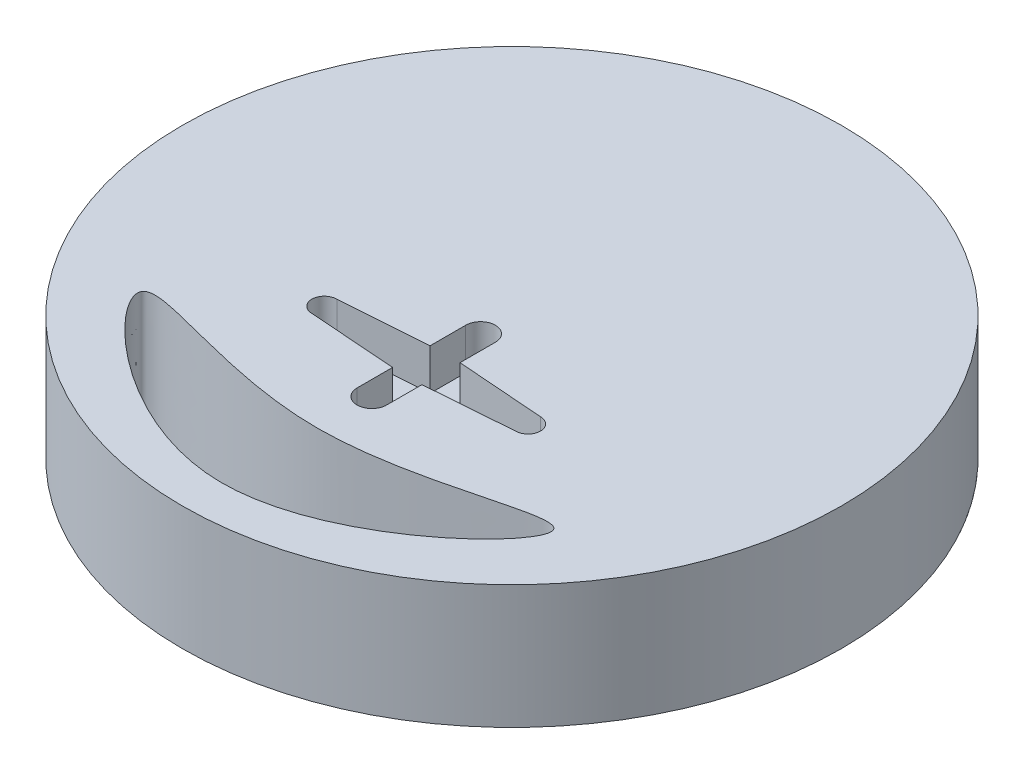
ISO-10303-21;
HEADER;
FILE_DESCRIPTION(('STEP AP214'),'2;1');
FILE_NAME('part.step','',(''),(''),'','','');
FILE_SCHEMA(('AUTOMOTIVE_DESIGN { 1 0 10303 214 1 1 1 1 }'));
ENDSEC;
DATA;
#1=APPLICATION_CONTEXT('core data for automotive mechanical design processes');
#2=APPLICATION_PROTOCOL_DEFINITION('international standard','automotive_design',2000,#1);
#3=PRODUCT_CONTEXT('',#1,'mechanical');
#4=PRODUCT('Part','Part','',(#3));
#5=PRODUCT_RELATED_PRODUCT_CATEGORY('part','',(#4));
#6=PRODUCT_DEFINITION_FORMATION('','',#4);
#7=PRODUCT_DEFINITION_CONTEXT('part definition',#1,'design');
#8=PRODUCT_DEFINITION('design','',#6,#7);
#9=PRODUCT_DEFINITION_SHAPE('','',#8);
#10=(LENGTH_UNIT() NAMED_UNIT(*) SI_UNIT(.MILLI.,.METRE.));
#11=(NAMED_UNIT(*) PLANE_ANGLE_UNIT() SI_UNIT($,.RADIAN.));
#12=(NAMED_UNIT(*) SI_UNIT($,.STERADIAN.) SOLID_ANGLE_UNIT());
#13=UNCERTAINTY_MEASURE_WITH_UNIT(LENGTH_MEASURE(1.E-05),#10,'distance_accuracy_value','');
#14=(GEOMETRIC_REPRESENTATION_CONTEXT(3) GLOBAL_UNCERTAINTY_ASSIGNED_CONTEXT((#13)) GLOBAL_UNIT_ASSIGNED_CONTEXT((#10,
#11,#12)) REPRESENTATION_CONTEXT('',''));
#15=CARTESIAN_POINT('',(0.,0.,0.));
#16=DIRECTION('',(0.,0.,1.));
#17=DIRECTION('',(1.,0.,0.));
#18=AXIS2_PLACEMENT_3D('',#15,#16,#17);
#19=CARTESIAN_POINT('',(0.,0.,0.));
#20=DIRECTION('',(0.,1.,0.));
#21=DIRECTION('',(0.,0.,-1.));
#22=AXIS2_PLACEMENT_3D('',#19,#20,#21);
#23=CONICAL_SURFACE('',#22,50.8,0.436332312998583);
#24=CARTESIAN_POINT('',(-4.94064954388163,-15.9612397023863,-43.0747325589562));
#25=CARTESIAN_POINT('',(-4.78542381678616,-16.0934445827361,-43.0304845708124));
#26=CARTESIAN_POINT('',(-4.62448546101738,-16.2197493159303,-42.9888860172424));
#27=CARTESIAN_POINT('',(-4.2920682727824,-16.4595657745197,-42.9109621062465));
#28=CARTESIAN_POINT('',(-4.12058803248645,-16.5730757854663,-42.8746374553179));
#29=CARTESIAN_POINT('',(-3.76813766102636,-16.7863109700731,-42.8072341013048));
#30=CARTESIAN_POINT('',(-3.58716177933412,-16.8860276544826,-42.776158626303));
#31=CARTESIAN_POINT('',(-3.2170403422337,-17.0707033866764,-42.719226750507));
#32=CARTESIAN_POINT('',(-3.02789483730488,-17.1556625256298,-42.6933703174704));
#33=CARTESIAN_POINT('',(-2.64267176605896,-17.3100885822414,-42.6467984673994));
#34=CARTESIAN_POINT('',(-2.44659121715198,-17.3795487379576,-42.6260852938384));
#35=CARTESIAN_POINT('',(-2.04897075342166,-17.5023028808692,-42.5897408430897));
#36=CARTESIAN_POINT('',(-1.8474307773734,-17.5555966866847,-42.5741096229194));
#37=CARTESIAN_POINT('',(-1.44040786501331,-17.6455227962455,-42.5478660226092));
#38=CARTESIAN_POINT('',(-1.23492609308615,-17.6821599436334,-42.5372521834134));
#39=CARTESIAN_POINT('',(-0.821384220979554,-17.7384754038288,-42.5209819446696));
#40=CARTESIAN_POINT('',(-0.613323257793733,-17.7581478758318,-42.5153272525056));
#41=CARTESIAN_POINT('',(-0.19858258810889,-17.7802099359792,-42.508987976848));
#42=CARTESIAN_POINT('',(0.00808599438565895,-17.7827931422066,-42.5082477134858));
#43=CARTESIAN_POINT('',(0.420915383227999,-17.7711675318268,-42.51158580484));
#44=CARTESIAN_POINT('',(0.627076180941762,-17.756958431643,-42.5156642409312));
#45=CARTESIAN_POINT('',(1.03740236410294,-17.7118735752539,-42.5286608289162));
#46=CARTESIAN_POINT('',(1.24156784753777,-17.680998641717,-42.5375787419211));
#47=CARTESIAN_POINT('',(1.64646041846587,-17.6028542289432,-42.5602980049135));
#48=CARTESIAN_POINT('',(1.84718750061752,-17.5555847242394,-42.5740993624868));
#49=CARTESIAN_POINT('',(2.24335367627987,-17.4451874992146,-42.6066112509265));
#50=CARTESIAN_POINT('',(2.43880325366779,-17.382094247127,-42.6253111154593));
#51=CARTESIAN_POINT('',(2.82349925506257,-17.2405548888415,-42.6677031299968));
#52=CARTESIAN_POINT('',(3.01274575608942,-17.162108973353,-42.6913952179887));
#53=CARTESIAN_POINT('',(3.38376692211739,-16.9905417327992,-42.7438442712354));
#54=CARTESIAN_POINT('',(3.56554052149323,-16.8974183238329,-42.7726019557686));
#55=CARTESIAN_POINT('',(3.920312329206,-16.6973550113927,-42.8352264454007));
#56=CARTESIAN_POINT('',(4.09331338622711,-16.5904196335745,-42.8690915775905));
#57=CARTESIAN_POINT('',(4.43107764280676,-16.3625673944883,-42.9423168263288));
#58=CARTESIAN_POINT('',(4.59574749035882,-16.2415279008206,-42.981725869367));
#59=CARTESIAN_POINT('',(4.91403936923113,-15.987357600568,-43.0657923165766));
#60=CARTESIAN_POINT('',(5.06766138028412,-15.8542267718025,-43.1104497303758));
#61=CARTESIAN_POINT('',(5.36293786554785,-15.5770377547202,-43.2049634936671));
#62=CARTESIAN_POINT('',(5.50459391375098,-15.4329810083352,-43.2548191574522));
#63=CARTESIAN_POINT('',(5.77524909961291,-15.135079374046,-43.3596587363182));
#64=CARTESIAN_POINT('',(5.90424367526188,-14.9812309908243,-43.4146444859848));
#65=CARTESIAN_POINT('',(6.15258378843135,-14.6602789486335,-43.5313107549775));
#66=CARTESIAN_POINT('',(6.27152279281264,-14.4929158717343,-43.5931428187805));
#67=CARTESIAN_POINT('',(6.49478625624578,-14.1504820685431,-43.7218769426413));
#68=CARTESIAN_POINT('',(6.59910536486851,-13.9754085511144,-43.7887808451039));
#69=CARTESIAN_POINT('',(6.79270617148461,-13.6189975271888,-43.9273464013323));
#70=CARTESIAN_POINT('',(6.88199051102022,-13.4376611278136,-43.9990072162385));
#71=CARTESIAN_POINT('',(7.04536014889055,-13.0699477484179,-44.1467889758281));
#72=CARTESIAN_POINT('',(7.11943969268534,-12.8835688900779,-44.2229115952043));
#73=CARTESIAN_POINT('',(7.25644411232013,-12.4952572349125,-44.3841282881857));
#74=CARTESIAN_POINT('',(7.31837554105366,-12.293082997354,-44.4694855312151));
#75=CARTESIAN_POINT('',(7.42495732904638,-11.8858982017481,-44.6443064671316));
#76=CARTESIAN_POINT('',(7.46960120446606,-11.680886609328,-44.7337716867045));
#77=CARTESIAN_POINT('',(7.54169644389535,-11.2694257159537,-44.9162387099558));
#78=CARTESIAN_POINT('',(7.56914853765107,-11.0629764764001,-45.0092403633441));
#79=CARTESIAN_POINT('',(7.60707096357232,-10.6498485961495,-45.1982106567499));
#80=CARTESIAN_POINT('',(7.6175351822263,-10.4431698996405,-45.2941803522357));
#81=CARTESIAN_POINT('',(7.62412501240004,-9.78865368497306,-45.6025599419786));
#82=CARTESIAN_POINT('',(7.58903763881434,-9.34228561748734,-45.819518506158));
#83=CARTESIAN_POINT('',(7.44232313096322,-8.46459011675443,-46.2581572169124));
#84=CARTESIAN_POINT('',(7.33066121101305,-8.0332696128148,-46.4798394649614));
#85=CARTESIAN_POINT('',(7.10306139103742,-7.39102016310779,-46.8178443708605));
#86=CARTESIAN_POINT('',(7.01334072017891,-7.1710133207354,-46.9351468605341));
#87=CARTESIAN_POINT('',(6.8133332916047,-6.73956503593674,-47.1678828035859));
#88=CARTESIAN_POINT('',(6.70305398775994,-6.52812052281115,-47.2833169179405));
#89=CARTESIAN_POINT('',(6.46227683259978,-6.11518328479115,-47.5111605695698));
#90=CARTESIAN_POINT('',(6.33176888980107,-5.91369559359481,-47.6235685641702));
#91=CARTESIAN_POINT('',(6.05100070555801,-5.52235161797404,-47.8440013748957));
#92=CARTESIAN_POINT('',(5.90073846170917,-5.33249651555679,-47.9520257452178));
#93=CARTESIAN_POINT('',(5.58387657652374,-4.96945794585552,-48.1603690016013));
#94=CARTESIAN_POINT('',(5.41761786349451,-4.79603673170848,-48.2607912643954));
#95=CARTESIAN_POINT('',(5.06732238752572,-4.46396200433227,-48.4545225808732));
#96=CARTESIAN_POINT('',(4.88329510983054,-4.3053006997966,-48.5478353826617));
#97=CARTESIAN_POINT('',(4.49837958276756,-4.00462935944555,-48.7258143238974));
#98=CARTESIAN_POINT('',(4.2975003884272,-3.86261047826306,-48.8104850534482));
#99=CARTESIAN_POINT('',(3.88002648036769,-3.59715413033617,-48.9696147317948));
#100=CARTESIAN_POINT('',(3.66343484140377,-3.47371304257759,-49.0440756703379));
#101=CARTESIAN_POINT('',(3.24412279568124,-3.2615814754616,-49.1726051324605));
#102=CARTESIAN_POINT('',(3.04304662883241,-3.17047652960923,-49.2280589846383));
#103=CARTESIAN_POINT('',(2.63155814758678,-3.00539180242085,-49.3288583215697));
#104=CARTESIAN_POINT('',(2.42114771534955,-2.93140858719818,-49.3742058331553));
#105=CARTESIAN_POINT('',(1.99293915622632,-2.80183587414655,-49.453811372613));
#106=CARTESIAN_POINT('',(1.77514914933112,-2.7462268396379,-49.4880811782094));
#107=CARTESIAN_POINT('',(1.3340334695487,-2.65430321500096,-49.5448152223458));
#108=CARTESIAN_POINT('',(1.11070869079266,-2.61798552938708,-49.5672813548942));
#109=CARTESIAN_POINT('',(0.694058988458415,-2.56921821086434,-49.5974695764474));
#110=CARTESIAN_POINT('',(0.501170051903149,-2.55403735024322,-49.6068781431012));
#111=CARTESIAN_POINT('',(0.114573884359551,-2.5384067261275,-49.6165656643833));
#112=CARTESIAN_POINT('',(-0.0791332683923379,-2.53795558472487,-49.6168454729713));
#113=CARTESIAN_POINT('',(-0.465760498542645,-2.55178864647313,-49.6082716858447));
#114=CARTESIAN_POINT('',(-0.658680773519966,-2.56606888860061,-49.5994205452899));
#115=CARTESIAN_POINT('',(-1.04226447712294,-2.60915031885127,-49.5727493503648));
#116=CARTESIAN_POINT('',(-1.23292790888786,-2.63795148677346,-49.5549293084716));
#117=CARTESIAN_POINT('',(-1.60010738738229,-2.70768298899212,-49.511860746843));
#118=CARTESIAN_POINT('',(-1.77682304940351,-2.74785523477206,-49.4870770686027));
#119=CARTESIAN_POINT('',(-2.12589530156655,-2.84032921260624,-49.4301499905795));
#120=CARTESIAN_POINT('',(-2.29825048534985,-2.89263480400988,-49.3980042491281));
#121=CARTESIAN_POINT('',(-2.63750600024856,-3.00876928935041,-49.3268210368129));
#122=CARTESIAN_POINT('',(-2.80440779837309,-3.07259505361021,-49.2877854377753));
#123=CARTESIAN_POINT('',(-3.13201228839053,-3.21114773290973,-49.2033144575053));
#124=CARTESIAN_POINT('',(-3.29271259165456,-3.28587879638313,-49.1578766410631));
#125=CARTESIAN_POINT('',(-3.61688238695095,-3.45048342093602,-49.0581581383005));
#126=CARTESIAN_POINT('',(-3.77990667116278,-3.54100826458721,-49.0035040132382));
#127=CARTESIAN_POINT('',(-4.0974059482006,-3.73270697984957,-48.8882761822077));
#128=CARTESIAN_POINT('',(-4.25187781276202,-3.83388470926902,-48.8277003323335));
#129=CARTESIAN_POINT('',(-4.70154446224845,-4.15212206661073,-48.6381090617147));
#130=CARTESIAN_POINT('',(-4.98314520241094,-4.38396547086069,-48.5011813924464));
#131=CARTESIAN_POINT('',(-5.54074097670515,-4.91298141790584,-48.1925785474159));
#132=CARTESIAN_POINT('',(-5.81113439049339,-5.21473537183066,-48.018701782568));
#133=CARTESIAN_POINT('',(-6.29803076981837,-5.85184799876738,-47.6576186118188));
#134=CARTESIAN_POINT('',(-6.5145034829517,-6.18722538901312,-47.4704047985229));
#135=CARTESIAN_POINT('',(-6.91671515828582,-6.9311966694663,-47.0629988186111));
#136=CARTESIAN_POINT('',(-7.09445981032618,-7.3435815945777,-46.8417470355488));
#137=CARTESIAN_POINT('',(-7.30484612656631,-7.97970728130226,-46.5089117279273));
#138=CARTESIAN_POINT('',(-7.36562221829991,-8.19480506792741,-46.3977416061592));
#139=CARTESIAN_POINT('',(-7.46812598877368,-8.62983885324082,-46.1758703323664));
#140=CARTESIAN_POINT('',(-7.50985124858616,-8.84977546261133,-46.0651692416626));
#141=CARTESIAN_POINT('',(-7.57597296624918,-9.30788060946147,-45.8378423220908));
#142=CARTESIAN_POINT('',(-7.59903356791025,-9.54628945055965,-45.7213116506189));
#143=CARTESIAN_POINT('',(-7.62258298154331,-10.0253859968846,-45.4908859498037));
#144=CARTESIAN_POINT('',(-7.62308025462988,-10.266072814018,-45.3769899484889));
#145=CARTESIAN_POINT('',(-7.60109622774876,-10.7482257346369,-45.1526984827524));
#146=CARTESIAN_POINT('',(-7.57860055975343,-10.9896922312875,-45.0423052516438));
#147=CARTESIAN_POINT('',(-7.51026980338654,-11.4712400857959,-44.826085617354));
#148=CARTESIAN_POINT('',(-7.46444629469419,-11.7113220711695,-44.7202569766058));
#149=CARTESIAN_POINT('',(-7.35112687752598,-12.1802961581998,-44.517389782394));
#150=CARTESIAN_POINT('',(-7.28439325415942,-12.4092966026791,-44.4201766099671));
#151=CARTESIAN_POINT('',(-7.12886544872208,-12.8620237851206,-44.2315806532252));
#152=CARTESIAN_POINT('',(-7.04008227188885,-13.0857530931724,-44.1401949888309));
#153=CARTESIAN_POINT('',(-6.84072116841345,-13.5255818995758,-43.9639786628871));
#154=CARTESIAN_POINT('',(-6.73017274402572,-13.7416912641262,-43.8791393422448));
#155=CARTESIAN_POINT('',(-6.48768201233099,-14.1642111632018,-43.716475028455));
#156=CARTESIAN_POINT('',(-6.35574762345556,-14.3706252511837,-43.6386474556473));
#157=CARTESIAN_POINT('',(-6.03307255244352,-14.8251295854521,-43.4705865876554));
#158=CARTESIAN_POINT('',(-5.8360381133416,-15.0696202482003,-43.3825943449552));
#159=CARTESIAN_POINT('',(-5.41084620407821,-15.5346003429879,-43.2191660441501));
#160=CARTESIAN_POINT('',(-5.18269274815035,-15.7550928641102,-43.1437283693361));
#161=CARTESIAN_POINT('',(-4.94064954388163,-15.9612397023863,-43.0747325589562));
#162=B_SPLINE_CURVE_WITH_KNOTS('',3,(#24,#25,#26,#27,#28,#29,#30,#31,#32,#33,#34,#35,#36,#37,
#38,#39,#40,#41,#42,#43,#44,#45,#46,#47,#48,#49,#50,#51,#52,#53,#54,#55,#56,#57,#58,#59,#60,#61,
#62,#63,#64,#65,#66,#67,#68,#69,#70,#71,#72,#73,#74,#75,#76,#77,#78,#79,#80,#81,#82,#83,#84,#85,
#86,#87,#88,#89,#90,#91,#92,#93,#94,#95,#96,#97,#98,#99,#100,#101,#102,#103,#104,#105,#106,#107,
#108,#109,#110,#111,#112,#113,#114,#115,#116,#117,#118,#119,#120,#121,#122,#123,#124,#125,#126,
#127,#128,#129,#130,#131,#132,#133,#134,#135,#136,#137,#138,#139,#140,#141,#142,#143,#144,#145,
#146,#147,#148,#149,#150,#151,#152,#153,#154,#155,#156,#157,#158,#159,#160,#161),.UNSPECIFIED.,
.T.,.F.,(4,2,2,2,2,2,2,2,2,2,2,2,2,2,2,2,2,2,2,2,2,2,2,2,2,2,2,2,2,2,2,2,2,2,2,2,2,2,2,2,2,2,2,
2,2,2,2,2,2,2,2,2,2,2,2,2,2,2,2,2,2,2,2,2,2,2,2,2,4),(0.,0.625654194815607,1.25139212571434,
1.87751347630843,2.50363095870924,3.13002107368822,3.75641821624921,4.38263309010459,
5.00906347884563,5.6283841949057,6.24771536976786,6.8670159756496,7.48631754354006,
8.10428165341961,8.72223808749009,9.34028233777179,9.95812458981055,10.5818083945611,
11.2054933434307,11.8290961251556,12.4529227764752,13.0954989001266,13.7383095760587,
14.3810071949018,15.0239476079969,15.7072890648919,16.3908865669755,17.0744550501689,
17.7582694780822,19.244123969548,20.7306538908613,21.524782455523,22.3186236538013,
23.1128621587542,23.9071812342506,24.6872694405925,25.4669434973728,26.2462012634191,
27.0253069463871,27.7071425208825,28.3888412295956,29.0698127597146,29.7506749882587,
30.3310672469689,30.9114052120814,31.4915871746526,32.0717683300968,32.6198931615292,
33.1681925790165,33.7163432639833,34.2647030145936,34.8470343887665,35.4295773769989,
36.5941264876107,37.9117401104199,39.2300913283667,40.7249382079342,41.4732389943382,
42.2216347677988,43.0197652074483,43.8175963504356,44.615926354026,45.4138604613736,
46.1855534183894,46.9568619841083,47.7271321699698,48.4971178020217,49.4728250353663,
50.4484065250519),.UNSPECIFIED.);
#163=CARTESIAN_POINT('',(-4.94064954388163,-15.9612397023863,-43.0747325589562));
#164=VERTEX_POINT('',#163);
#165=EDGE_CURVE('E116',#164,#164,#162,.T.);
#166=ORIENTED_EDGE('',*,*,#165,.T.);
#167=EDGE_LOOP('',(#166));
#168=FACE_BOUND('',#167,.T.);
#169=CARTESIAN_POINT('',(0.,0.,0.));
#170=DIRECTION('',(0.,-1.,0.));
#171=DIRECTION('',(0.,0.,-1.));
#172=AXIS2_PLACEMENT_3D('',#169,#170,#171);
#173=CIRCLE('',#172,50.8);
#174=CARTESIAN_POINT('',(-44.4378772627048,0.,-24.6153420529715));
#175=VERTEX_POINT('',#174);
#176=CARTESIAN_POINT('',(44.4378772627048,0.,-24.6153420529715));
#177=VERTEX_POINT('',#176);
#178=EDGE_CURVE('E102',#175,#177,#173,.T.);
#179=ORIENTED_EDGE('',*,*,#178,.T.);
#180=CARTESIAN_POINT('',(25.1966605302614,-19.05,-33.4985029408242));
#181=CARTESIAN_POINT('',(25.6655434032636,-18.7140361881099,-33.3418404424769));
#182=CARTESIAN_POINT('',(26.1293846111233,-18.3723337848862,-33.1825019950437));
#183=CARTESIAN_POINT('',(27.0472696427902,-17.6783601409286,-32.8588967703086));
#184=CARTESIAN_POINT('',(27.5013144000333,-17.3260899148433,-32.694630466145));
#185=CARTESIAN_POINT('',(28.3997404352072,-16.6120164043351,-32.3616525197094));
#186=CARTESIAN_POINT('',(28.8441267791353,-16.2502183490027,-32.1929433158023));
#187=CARTESIAN_POINT('',(29.7238304779451,-15.5176726935929,-31.8513516667366));
#188=CARTESIAN_POINT('',(30.1591475933975,-15.1469248577959,-31.67846911166));
#189=CARTESIAN_POINT('',(31.4480003348301,-14.0258131649598,-31.1556861436434));
#190=CARTESIAN_POINT('',(32.2886362519184,-13.2632244743252,-30.8000851971781));
#191=CARTESIAN_POINT('',(33.9380197938201,-11.7101496466371,-30.0758745113394));
#192=CARTESIAN_POINT('',(34.7467627159158,-10.9196594277441,-29.707262868573));
#193=CARTESIAN_POINT('',(36.3335284974515,-9.31601646271963,-28.9594718730357));
#194=CARTESIAN_POINT('',(37.1115973770021,-8.5029010517763,-28.580309929949));
#195=CARTESIAN_POINT('',(38.6406303518196,-6.85606474597936,-27.8123775488282));
#196=CARTESIAN_POINT('',(39.3915947104501,-6.02234405147161,-27.4236072042169));
#197=CARTESIAN_POINT('',(40.8720407150352,-4.33295263534972,-26.6358310492579));
#198=CARTESIAN_POINT('',(41.601403850738,-3.47719669575725,-26.2367855011143));
#199=CARTESIAN_POINT('',(42.6779156248753,-2.18173549922506,-25.6327020243287));
#200=CARTESIAN_POINT('',(43.0338096690425,-1.74797055931725,-25.4304341110106));
#201=CARTESIAN_POINT('',(43.7399901780582,-0.876720280559472,-25.0241634338561));
#202=CARTESIAN_POINT('',(44.0902767571993,-0.439235017816914,-24.8201607055093));
#203=CARTESIAN_POINT('',(44.4378772627048,0.,-24.6153420529715));
#204=B_SPLINE_CURVE_WITH_KNOTS('',3,(#180,#181,#182,#183,#184,#185,#186,#187,#188,#189,#190,
#191,#192,#193,#194,#195,#196,#197,#198,#199,#200,#201,#202,#203),.UNSPECIFIED.,.F.,.F.,(4,2,2,
2,2,2,2,2,2,2,2,4),(0.,1.79305564995433,3.5859396907591,5.3778594597075,7.16982647588538,
10.7369779242623,14.3046534079525,17.8667550969064,21.4288221650419,25.0077497428421,
26.7969964519758,28.5862066457578),.UNSPECIFIED.);
#205=CARTESIAN_POINT('',(25.1966605302614,-19.05,-33.4985029408242));
#206=VERTEX_POINT('',#205);
#207=EDGE_CURVE('E12',#206,#177,#204,.T.);
#208=ORIENTED_EDGE('',*,*,#207,.F.);
#209=CARTESIAN_POINT('',(0.,-19.05,0.));
#210=DIRECTION('',(0.,-1.,0.));
#211=DIRECTION('',(0.,0.,-1.));
#212=AXIS2_PLACEMENT_3D('',#209,#210,#211);
#213=CIRCLE('',#212,41.9168391121473);
#214=CARTESIAN_POINT('',(-25.1966605302614,-19.05,-33.4985029408242));
#215=VERTEX_POINT('',#214);
#216=EDGE_CURVE('E131',#215,#206,#213,.T.);
#217=ORIENTED_EDGE('',*,*,#216,.F.);
#218=CARTESIAN_POINT('',(-25.1966605302614,-19.05,-33.4985029408242));
#219=CARTESIAN_POINT('',(-25.6655434032636,-18.7140361881099,-33.3418404424769));
#220=CARTESIAN_POINT('',(-26.1293846111233,-18.3723337848862,-33.1825019950437));
#221=CARTESIAN_POINT('',(-27.0472696427902,-17.6783601409286,-32.8588967703086));
#222=CARTESIAN_POINT('',(-27.5013144000333,-17.3260899148433,-32.694630466145));
#223=CARTESIAN_POINT('',(-28.3997404352072,-16.6120164043351,-32.3616525197094));
#224=CARTESIAN_POINT('',(-28.8441267791353,-16.2502183490027,-32.1929433158023));
#225=CARTESIAN_POINT('',(-29.7238304779451,-15.5176726935929,-31.8513516667366));
#226=CARTESIAN_POINT('',(-30.1591475933975,-15.1469248577959,-31.67846911166));
#227=CARTESIAN_POINT('',(-31.4480003348301,-14.0258131649598,-31.1556861436434));
#228=CARTESIAN_POINT('',(-32.2886362519184,-13.2632244743252,-30.8000851971781));
#229=CARTESIAN_POINT('',(-33.9380197938201,-11.7101496466371,-30.0758745113394));
#230=CARTESIAN_POINT('',(-34.7467627159158,-10.9196594277441,-29.707262868573));
#231=CARTESIAN_POINT('',(-36.3335284974515,-9.31601646271963,-28.9594718730357));
#232=CARTESIAN_POINT('',(-37.1115973770021,-8.5029010517763,-28.580309929949));
#233=CARTESIAN_POINT('',(-38.6406303518196,-6.85606474597936,-27.8123775488282));
#234=CARTESIAN_POINT('',(-39.3915947104501,-6.02234405147161,-27.4236072042169));
#235=CARTESIAN_POINT('',(-40.8720407150352,-4.33295263534972,-26.6358310492579));
#236=CARTESIAN_POINT('',(-41.601403850738,-3.47719669575725,-26.2367855011143));
#237=CARTESIAN_POINT('',(-42.6779156248753,-2.18173549922506,-25.6327020243287));
#238=CARTESIAN_POINT('',(-43.0338096690425,-1.74797055931725,-25.4304341110106));
#239=CARTESIAN_POINT('',(-43.7399901780582,-0.876720280559472,-25.0241634338561));
#240=CARTESIAN_POINT('',(-44.0902767571993,-0.439235017816914,-24.8201607055093));
#241=CARTESIAN_POINT('',(-44.4378772627048,0.,-24.6153420529715));
#242=B_SPLINE_CURVE_WITH_KNOTS('',3,(#218,#219,#220,#221,#222,#223,#224,#225,#226,#227,#228,
#229,#230,#231,#232,#233,#234,#235,#236,#237,#238,#239,#240,#241),.UNSPECIFIED.,.F.,.F.,(4,2,2,
2,2,2,2,2,2,2,2,4),(0.,1.79305564995433,3.5859396907591,5.3778594597075,7.16982647588538,
10.7369779242623,14.3046534079525,17.8667550969064,21.4288221650419,25.0077497428421,
26.7969964519758,28.5862066457578),.UNSPECIFIED.);
#243=EDGE_CURVE('E115',#215,#175,#242,.T.);
#244=ORIENTED_EDGE('',*,*,#243,.T.);
#245=EDGE_LOOP('',(#179,#208,#217,#244));
#246=FACE_BOUND('',#245,.T.);
#247=ADVANCED_FACE('F43',(#168,#246),#23,.T.);
#248=CARTESIAN_POINT('',(25.3878772627048,0.,-24.6153420529715));
#249=DIRECTION('',(0.,-0.4226182617407,0.90630778703665));
#250=DIRECTION('',(0.,-0.90630778703665,-0.4226182617407));
#251=AXIS2_PLACEMENT_3D('',#248,#249,#250);
#252=PLANE('',#251);
#253=DIRECTION('',(-1.,0.,0.));
#254=VECTOR('',#253,1.);
#255=CARTESIAN_POINT('',(25.3878772627048,0.,-24.6153420529715));
#256=LINE('',#255,#254);
#257=CARTESIAN_POINT('',(25.3878772627048,0.,-24.6153420529715));
#258=VERTEX_POINT('',#257);
#259=EDGE_CURVE('E98',#177,#258,#256,.T.);
#260=ORIENTED_EDGE('',*,*,#259,.T.);
#261=DIRECTION('',(0.308248016118225,0.862176061817301,0.402039300303326));
#262=VECTOR('',#261,1.);
#263=CARTESIAN_POINT('',(25.3878772627048,0.,-24.6153420529715));
#264=LINE('',#263,#262);
#265=CARTESIAN_POINT('',(18.5770587221449,-19.05,-33.4985029408242));
#266=VERTEX_POINT('',#265);
#267=EDGE_CURVE('E52',#266,#258,#264,.T.);
#268=ORIENTED_EDGE('',*,*,#267,.F.);
#269=DIRECTION('',(1.,0.,0.));
#270=VECTOR('',#269,1.);
#271=CARTESIAN_POINT('',(25.3878772627048,-19.05,-33.4985029408242));
#272=LINE('',#271,#270);
#273=EDGE_CURVE('E111',#206,#266,#272,.F.);
#274=ORIENTED_EDGE('',*,*,#273,.F.);
#275=ORIENTED_EDGE('',*,*,#207,.T.);
#276=EDGE_LOOP('',(#260,#268,#274,#275));
#277=FACE_BOUND('',#276,.T.);
#278=ADVANCED_FACE('F110',(#277),#252,.T.);
#279=CARTESIAN_POINT('',(14.224,0.,16.9199535512611));
#280=DIRECTION('',(0.875243936985389,-0.4226182617407,0.235248497579869));
#281=DIRECTION('',(0.434821412810883,0.90051670665299,0.));
#282=AXIS2_PLACEMENT_3D('',#279,#280,#281);
#283=PLANE('',#282);
#284=DIRECTION('',(-0.259567997698729,0.,0.965724833775477));
#285=VECTOR('',#284,1.);
#286=CARTESIAN_POINT('',(14.224,0.,16.9199535512611));
#287=LINE('',#286,#285);
#288=CARTESIAN_POINT('',(14.224,0.,16.9199535512611));
#289=VERTEX_POINT('',#288);
#290=EDGE_CURVE('E104',#258,#289,#287,.T.);
#291=ORIENTED_EDGE('',*,*,#290,.T.);
#292=DIRECTION('',(0.308248016118225,0.862176061817301,0.402039300303326));
#293=VECTOR('',#292,1.);
#294=CARTESIAN_POINT('',(11.6657666148953,-7.15543156758921,13.5833210138902));
#295=LINE('',#294,#293);
#296=CARTESIAN_POINT('',(7.4131814594401,-19.05,8.03679266340831));
#297=VERTEX_POINT('',#296);
#298=EDGE_CURVE('E174',#297,#289,#295,.T.);
#299=ORIENTED_EDGE('',*,*,#298,.F.);
#300=DIRECTION('',(0.259567997698729,0.,-0.965724833775477));
#301=VECTOR('',#300,1.);
#302=CARTESIAN_POINT('',(5.64531092817759,-19.05,14.6141692663655));
#303=LINE('',#302,#301);
#304=EDGE_CURVE('E184',#266,#297,#303,.F.);
#305=ORIENTED_EDGE('',*,*,#304,.F.);
#306=ORIENTED_EDGE('',*,*,#267,.T.);
#307=EDGE_LOOP('',(#291,#299,#305,#306));
#308=FACE_BOUND('',#307,.T.);
#309=ADVANCED_FACE('F45',(#308),#283,.T.);
#310=CARTESIAN_POINT('',(-12.7,0.,16.9199535512611));
#311=DIRECTION('',(0.,-0.4226182617407,0.90630778703665));
#312=DIRECTION('',(0.,-0.90630778703665,-0.4226182617407));
#313=AXIS2_PLACEMENT_3D('',#310,#311,#312);
#314=PLANE('',#313);
#315=CARTESIAN_POINT('',(0.,-10.16,12.1822677444063));
#316=DIRECTION('',(0.,-0.4226182617407,0.90630778703665));
#317=DIRECTION('',(0.,0.90630778703665,0.4226182617407));
#318=AXIS2_PLACEMENT_3D('',#315,#316,#317);
#319=ELLIPSE('',#318,8.40773974249419,7.62);
#320=CARTESIAN_POINT('',(0.,-2.54,15.7355320995474));
#321=VERTEX_POINT('',#320);
#322=EDGE_CURVE('E47',#321,#321,#319,.F.);
#323=ORIENTED_EDGE('',*,*,#322,.T.);
#324=EDGE_LOOP('',(#323));
#325=FACE_BOUND('',#324,.T.);
#326=DIRECTION('',(-1.,0.,0.));
#327=VECTOR('',#326,1.);
#328=CARTESIAN_POINT('',(-12.7,0.,16.9199535512611));
#329=LINE('',#328,#327);
#330=CARTESIAN_POINT('',(-12.7,0.,16.9199535512611));
#331=VERTEX_POINT('',#330);
#332=EDGE_CURVE('E126',#289,#331,#329,.T.);
#333=ORIENTED_EDGE('',*,*,#332,.T.);
#334=DIRECTION('',(-0.298534422054389,0.864979125821701,0.403346390514876));
#335=VECTOR('',#334,1.);
#336=CARTESIAN_POINT('',(-12.7,0.,16.9199535512611));
#337=LINE('',#336,#335);
#338=CARTESIAN_POINT('',(-6.12518152130715,-19.05,8.03679266340831));
#339=VERTEX_POINT('',#338);
#340=EDGE_CURVE('E172',#339,#331,#337,.T.);
#341=ORIENTED_EDGE('',*,*,#340,.F.);
#342=DIRECTION('',(1.,0.,0.));
#343=VECTOR('',#342,1.);
#344=CARTESIAN_POINT('',(-12.7,-19.05,8.03679266340831));
#345=LINE('',#344,#343);
#346=EDGE_CURVE('E186',#297,#339,#345,.F.);
#347=ORIENTED_EDGE('',*,*,#346,.F.);
#348=ORIENTED_EDGE('',*,*,#298,.T.);
#349=EDGE_LOOP('',(#333,#341,#347,#348));
#350=FACE_BOUND('',#349,.T.);
#351=ADVANCED_FACE('F157',(#325,#350),#314,.T.);
#352=CARTESIAN_POINT('',(-12.7,0.,16.9199535512611));
#353=DIRECTION('',(-0.866769069756242,-0.4226182617407,0.264773836617534));
#354=DIRECTION('',(0.438259507378909,-0.898848487895483,0.));
#355=AXIS2_PLACEMENT_3D('',#352,#353,#354);
#356=PLANE('',#355);
#357=DIRECTION('',(-0.29214560484277,0.,-0.956373852408697));
#358=VECTOR('',#357,1.);
#359=CARTESIAN_POINT('',(-12.7,0.,16.9199535512611));
#360=LINE('',#359,#358);
#361=CARTESIAN_POINT('',(-25.3878772627048,0.,-24.6153420529715));
#362=VERTEX_POINT('',#361);
#363=EDGE_CURVE('E128',#331,#362,#360,.T.);
#364=ORIENTED_EDGE('',*,*,#363,.T.);
#365=DIRECTION('',(-0.298534422054389,0.864979125821701,0.403346390514876));
#366=VECTOR('',#365,1.);
#367=CARTESIAN_POINT('',(-29.2584785778447,11.2147514478717,-19.385817568524));
#368=LINE('',#367,#366);
#369=CARTESIAN_POINT('',(-18.813058784012,-19.05,-33.4985029408242));
#370=VERTEX_POINT('',#369);
#371=EDGE_CURVE('E177',#370,#362,#368,.T.);
#372=ORIENTED_EDGE('',*,*,#371,.F.);
#373=DIRECTION('',(0.29214560484277,0.,0.956373852408697));
#374=VECTOR('',#373,1.);
#375=CARTESIAN_POINT('',(-4.20437720011801,-19.05,14.3247771407637));
#376=LINE('',#375,#374);
#377=EDGE_CURVE('E65',#339,#370,#376,.F.);
#378=ORIENTED_EDGE('',*,*,#377,.F.);
#379=ORIENTED_EDGE('',*,*,#340,.T.);
#380=EDGE_LOOP('',(#364,#372,#378,#379));
#381=FACE_BOUND('',#380,.T.);
#382=ADVANCED_FACE('F154',(#381),#356,.T.);
#383=CARTESIAN_POINT('',(-44.4378772627048,0.,-24.6153420529715));
#384=DIRECTION('',(0.,-0.4226182617407,0.90630778703665));
#385=DIRECTION('',(0.,-0.90630778703665,-0.4226182617407));
#386=AXIS2_PLACEMENT_3D('',#383,#384,#385);
#387=PLANE('',#386);
#388=DIRECTION('',(-1.,0.,0.));
#389=VECTOR('',#388,1.);
#390=CARTESIAN_POINT('',(-44.4378772627048,0.,-24.6153420529715));
#391=LINE('',#390,#389);
#392=EDGE_CURVE('E130',#362,#175,#391,.T.);
#393=ORIENTED_EDGE('',*,*,#392,.T.);
#394=ORIENTED_EDGE('',*,*,#243,.F.);
#395=DIRECTION('',(1.,0.,0.));
#396=VECTOR('',#395,1.);
#397=CARTESIAN_POINT('',(-44.4378772627048,-19.05,-33.4985029408242));
#398=LINE('',#397,#396);
#399=EDGE_CURVE('E60',#370,#215,#398,.F.);
#400=ORIENTED_EDGE('',*,*,#399,.F.);
#401=ORIENTED_EDGE('',*,*,#371,.T.);
#402=EDGE_LOOP('',(#393,#394,#400,#401));
#403=FACE_BOUND('',#402,.T.);
#404=ADVANCED_FACE('F147',(#403),#387,.T.);
#405=CARTESIAN_POINT('',(0.,-19.05,0.));
#406=DIRECTION('',(0.,-1.,0.));
#407=DIRECTION('',(0.,0.,-1.));
#408=AXIS2_PLACEMENT_3D('',#405,#406,#407);
#409=PLANE('',#408);
#410=ORIENTED_EDGE('',*,*,#216,.T.);
#411=ORIENTED_EDGE('',*,*,#273,.T.);
#412=ORIENTED_EDGE('',*,*,#304,.T.);
#413=ORIENTED_EDGE('',*,*,#346,.T.);
#414=ORIENTED_EDGE('',*,*,#377,.T.);
#415=ORIENTED_EDGE('',*,*,#399,.T.);
#416=EDGE_LOOP('',(#410,#411,#412,#413,#414,#415));
#417=FACE_BOUND('',#416,.T.);
#418=ADVANCED_FACE('F153',(#417),#409,.T.);
#419=CARTESIAN_POINT('',(0.,0.,0.));
#420=DIRECTION('',(0.,-1.,0.));
#421=DIRECTION('',(0.,0.,-1.));
#422=AXIS2_PLACEMENT_3D('',#419,#420,#421);
#423=PLANE('',#422);
#424=ORIENTED_EDGE('',*,*,#178,.F.);
#425=ORIENTED_EDGE('',*,*,#392,.F.);
#426=ORIENTED_EDGE('',*,*,#363,.F.);
#427=ORIENTED_EDGE('',*,*,#332,.F.);
#428=ORIENTED_EDGE('',*,*,#290,.F.);
#429=ORIENTED_EDGE('',*,*,#259,.F.);
#430=EDGE_LOOP('',(#424,#425,#426,#427,#428,#429));
#431=FACE_BOUND('',#430,.T.);
#432=ADVANCED_FACE('F99',(#431),#423,.F.);
#433=CARTESIAN_POINT('',(0.,-10.16,-50.8));
#434=DIRECTION('',(0.,0.,1.));
#435=DIRECTION('',(1.,0.,0.));
#436=AXIS2_PLACEMENT_3D('',#433,#434,#435);
#437=CYLINDRICAL_SURFACE('',#436,7.62);
#438=ORIENTED_EDGE('',*,*,#322,.F.);
#439=EDGE_LOOP('',(#438));
#440=FACE_BOUND('',#439,.T.);
#441=ORIENTED_EDGE('',*,*,#165,.F.);
#442=EDGE_LOOP('',(#441));
#443=FACE_BOUND('',#442,.T.);
#444=ADVANCED_FACE('F194',(#440,#443),#437,.F.);
#445=CLOSED_SHELL('',(#247,#278,#309,#351,#382,#404,#418,#432,#444));
#446=MANIFOLD_SOLID_BREP('B2',#445);
#447=CARTESIAN_POINT('',(0.,19.05,0.));
#448=DIRECTION('',(0.,-1.,0.));
#449=DIRECTION('',(0.,0.,-1.));
#450=AXIS2_PLACEMENT_3D('',#447,#448,#449);
#451=CYLINDRICAL_SURFACE('',#450,50.8);
#452=CARTESIAN_POINT('',(0.,19.05,0.));
#453=DIRECTION('',(0.,1.,0.));
#454=DIRECTION('',(0.,0.,1.));
#455=AXIS2_PLACEMENT_3D('',#452,#453,#454);
#456=CIRCLE('',#455,50.8);
#457=CARTESIAN_POINT('',(0.,19.05,50.8));
#458=VERTEX_POINT('',#457);
#459=EDGE_CURVE('E41',#458,#458,#456,.T.);
#460=ORIENTED_EDGE('',*,*,#459,.F.);
#461=EDGE_LOOP('',(#460));
#462=FACE_BOUND('',#461,.T.);
#463=CARTESIAN_POINT('',(0.,0.,0.));
#464=DIRECTION('',(0.,1.,0.));
#465=DIRECTION('',(0.,0.,1.));
#466=AXIS2_PLACEMENT_3D('',#463,#464,#465);
#467=CIRCLE('',#466,50.8);
#468=CARTESIAN_POINT('',(0.,0.,50.8));
#469=VERTEX_POINT('',#468);
#470=EDGE_CURVE('E256',#469,#469,#467,.T.);
#471=ORIENTED_EDGE('',*,*,#470,.T.);
#472=EDGE_LOOP('',(#471));
#473=FACE_BOUND('',#472,.T.);
#474=ADVANCED_FACE('F253',(#462,#473),#451,.T.);
#475=CARTESIAN_POINT('',(0.,19.05,0.));
#476=DIRECTION('',(0.,1.,0.));
#477=DIRECTION('',(0.,0.,1.));
#478=AXIS2_PLACEMENT_3D('',#475,#476,#477);
#479=PLANE('',#478);
#480=CARTESIAN_POINT('',(-31.75,19.05,25.3233254980439));
#481=CARTESIAN_POINT('',(-33.4284266205299,19.05,28.3503294759141));
#482=CARTESIAN_POINT('',(0.,19.05,61.0010777056909));
#483=CARTESIAN_POINT('',(47.8547480892713,19.05,14.2596217227584));
#484=CARTESIAN_POINT('',(0.,19.05,37.2991483423099));
#485=CARTESIAN_POINT('',(-30.3013214687414,19.05,22.7106669384516));
#486=CARTESIAN_POINT('',(-31.75,19.05,25.3233254980439));
#487=B_SPLINE_CURVE_WITH_KNOTS('',3,(#480,#481,#482,#483,#484,#485,#486),.UNSPECIFIED.,.T.,.F.,
(4,1,1,1,4),(0.,0.268367473919121,0.536734947838243,0.768367473919121,1.),.UNSPECIFIED.);
#488=CARTESIAN_POINT('',(-31.75,19.05,25.3233254980439));
#489=VERTEX_POINT('',#488);
#490=EDGE_CURVE('E629',#489,#489,#487,.T.);
#491=ORIENTED_EDGE('',*,*,#490,.F.);
#492=EDGE_LOOP('',(#491));
#493=FACE_BOUND('',#492,.T.);
#494=CARTESIAN_POINT('',(-15.6972,19.05,13.2074911700977));
#495=DIRECTION('',(0.,1.,0.));
#496=DIRECTION('',(0.,0.,1.));
#497=AXIS2_PLACEMENT_3D('',#494,#495,#496);
#498=CIRCLE('',#497,1.91719474067933);
#499=CARTESIAN_POINT('',(-15.6972,19.05,11.2902964294183));
#500=VERTEX_POINT('',#499);
#501=CARTESIAN_POINT('',(-15.6972,19.05,15.124685910777));
#502=VERTEX_POINT('',#501);
#503=EDGE_CURVE('E267',#500,#502,#498,.T.);
#504=ORIENTED_EDGE('',*,*,#503,.F.);
#505=DIRECTION('',(-0.997394111887519,0.,0.0721455859502616));
#506=VECTOR('',#505,1.);
#507=CARTESIAN_POINT('',(-15.6972,19.05,11.2902964294183));
#508=LINE('',#507,#506);
#509=CARTESIAN_POINT('',(-2.28193368815981,19.05,10.319915476482));
#510=VERTEX_POINT('',#509);
#511=EDGE_CURVE('E405',#510,#500,#508,.T.);
#512=ORIENTED_EDGE('',*,*,#511,.F.);
#513=DIRECTION('',(0.,0.,1.));
#514=VECTOR('',#513,1.);
#515=CARTESIAN_POINT('',(-2.28193368815981,19.05,4.83055216218953));
#516=LINE('',#515,#514);
#517=CARTESIAN_POINT('',(-2.28193368815981,19.05,4.83055216218953));
#518=VERTEX_POINT('',#517);
#519=EDGE_CURVE('E403',#518,#510,#516,.T.);
#520=ORIENTED_EDGE('',*,*,#519,.F.);
#521=CARTESIAN_POINT('',(0.,19.05,4.83055216218953));
#522=DIRECTION('',(0.,1.,0.));
#523=DIRECTION('',(0.,0.,1.));
#524=AXIS2_PLACEMENT_3D('',#521,#522,#523);
#525=CIRCLE('',#524,2.28193368815981);
#526=CARTESIAN_POINT('',(2.28193368815981,19.05,4.83055216218953));
#527=VERTEX_POINT('',#526);
#528=EDGE_CURVE('E351',#527,#518,#525,.T.);
#529=ORIENTED_EDGE('',*,*,#528,.F.);
#530=DIRECTION('',(0.,0.,-1.));
#531=VECTOR('',#530,1.);
#532=CARTESIAN_POINT('',(2.28193368815981,19.05,4.83055216218953));
#533=LINE('',#532,#531);
#534=CARTESIAN_POINT('',(2.28193368815981,19.05,10.2735056096836));
#535=VERTEX_POINT('',#534);
#536=EDGE_CURVE('E399',#535,#527,#533,.T.);
#537=ORIENTED_EDGE('',*,*,#536,.F.);
#538=DIRECTION('',(-0.997139984464473,0.,-0.0755767912932936));
#539=VECTOR('',#538,1.);
#540=CARTESIAN_POINT('',(2.28193368815981,19.05,10.2735056096836));
#541=LINE('',#540,#539);
#542=CARTESIAN_POINT('',(15.6972,19.05,11.2902964294183));
#543=VERTEX_POINT('',#542);
#544=EDGE_CURVE('E396',#543,#535,#541,.T.);
#545=ORIENTED_EDGE('',*,*,#544,.F.);
#546=CARTESIAN_POINT('',(15.6972,19.05,13.2074911700977));
#547=DIRECTION('',(0.,1.,0.));
#548=DIRECTION('',(0.,0.,1.));
#549=AXIS2_PLACEMENT_3D('',#546,#547,#548);
#550=CIRCLE('',#549,1.91719474067933);
#551=CARTESIAN_POINT('',(15.6972,19.05,15.124685910777));
#552=VERTEX_POINT('',#551);
#553=EDGE_CURVE('E393',#552,#543,#550,.T.);
#554=ORIENTED_EDGE('',*,*,#553,.F.);
#555=DIRECTION('',(0.997139984464473,0.,-0.0755767912932945));
#556=VECTOR('',#555,1.);
#557=CARTESIAN_POINT('',(2.28193368815981,19.05,16.1414767305117));
#558=LINE('',#557,#556);
#559=CARTESIAN_POINT('',(2.28193368815981,19.05,16.1414767305117));
#560=VERTEX_POINT('',#559);
#561=EDGE_CURVE('E390',#560,#552,#558,.T.);
#562=ORIENTED_EDGE('',*,*,#561,.F.);
#563=DIRECTION('',(0.,0.,-1.));
#564=VECTOR('',#563,1.);
#565=CARTESIAN_POINT('',(2.28193368815981,19.05,16.1414767305117));
#566=LINE('',#565,#564);
#567=CARTESIAN_POINT('',(2.28193368815981,19.05,21.5844301780058));
#568=VERTEX_POINT('',#567);
#569=EDGE_CURVE('E387',#568,#560,#566,.T.);
#570=ORIENTED_EDGE('',*,*,#569,.F.);
#571=CARTESIAN_POINT('',(0.,19.05,21.5844301780058));
#572=DIRECTION('',(0.,1.,0.));
#573=DIRECTION('',(0.,0.,1.));
#574=AXIS2_PLACEMENT_3D('',#571,#572,#573);
#575=CIRCLE('',#574,2.28193368815981);
#576=CARTESIAN_POINT('',(-2.28193368815981,19.05,21.5844301780058));
#577=VERTEX_POINT('',#576);
#578=EDGE_CURVE('E384',#577,#568,#575,.T.);
#579=ORIENTED_EDGE('',*,*,#578,.F.);
#580=DIRECTION('',(0.,0.,1.));
#581=VECTOR('',#580,1.);
#582=CARTESIAN_POINT('',(-2.28193368815981,19.05,16.0950668637133));
#583=LINE('',#582,#581);
#584=CARTESIAN_POINT('',(-2.28193368815981,19.05,16.0950668637133));
#585=VERTEX_POINT('',#584);
#586=EDGE_CURVE('E381',#585,#577,#583,.T.);
#587=ORIENTED_EDGE('',*,*,#586,.F.);
#588=DIRECTION('',(0.997394111887519,0.,0.0721455859502626));
#589=VECTOR('',#588,1.);
#590=CARTESIAN_POINT('',(-15.6972,19.05,15.124685910777));
#591=LINE('',#590,#589);
#592=EDGE_CURVE('E377',#502,#585,#591,.T.);
#593=ORIENTED_EDGE('',*,*,#592,.F.);
#594=EDGE_LOOP('',(#504,#512,#520,#529,#537,#545,#554,#562,#570,#579,#587,#593));
#595=FACE_BOUND('',#594,.T.);
#596=ORIENTED_EDGE('',*,*,#459,.T.);
#597=EDGE_LOOP('',(#596));
#598=FACE_BOUND('',#597,.T.);
#599=ADVANCED_FACE('F432',(#493,#595,#598),#479,.T.);
#600=CARTESIAN_POINT('',(0.,0.,0.));
#601=DIRECTION('',(0.,1.,0.));
#602=DIRECTION('',(0.,0.,1.));
#603=AXIS2_PLACEMENT_3D('',#600,#601,#602);
#604=PLANE('',#603);
#605=CARTESIAN_POINT('',(-31.75,0.,25.3233254980439));
#606=CARTESIAN_POINT('',(-33.4284266205299,0.,28.3503294759141));
#607=CARTESIAN_POINT('',(0.,0.,61.0010777056909));
#608=CARTESIAN_POINT('',(47.8547480892713,0.,14.2596217227584));
#609=CARTESIAN_POINT('',(0.,0.,37.2991483423099));
#610=CARTESIAN_POINT('',(-30.3013214687414,0.,22.7106669384516));
#611=CARTESIAN_POINT('',(-31.75,0.,25.3233254980439));
#612=B_SPLINE_CURVE_WITH_KNOTS('',3,(#605,#606,#607,#608,#609,#610,#611),.UNSPECIFIED.,.T.,.F.,
(4,1,1,1,4),(0.,0.268367473919121,0.536734947838243,0.768367473919121,1.),.UNSPECIFIED.);
#613=CARTESIAN_POINT('',(-31.75,0.,25.3233254980439));
#614=VERTEX_POINT('',#613);
#615=EDGE_CURVE('E378',#614,#614,#612,.T.);
#616=ORIENTED_EDGE('',*,*,#615,.T.);
#617=EDGE_LOOP('',(#616));
#618=FACE_BOUND('',#617,.T.);
#619=ORIENTED_EDGE('',*,*,#470,.F.);
#620=EDGE_LOOP('',(#619));
#621=FACE_BOUND('',#620,.T.);
#622=ADVANCED_FACE('F476',(#618,#621),#604,.F.);
#623=CARTESIAN_POINT('',(-15.6972,12.7,13.2074911700977));
#624=DIRECTION('',(0.,1.,0.));
#625=DIRECTION('',(0.,0.,1.));
#626=AXIS2_PLACEMENT_3D('',#623,#624,#625);
#627=CYLINDRICAL_SURFACE('',#626,1.91719474067933);
#628=ORIENTED_EDGE('',*,*,#503,.T.);
#629=DIRECTION('',(0.,1.,0.));
#630=VECTOR('',#629,1.);
#631=CARTESIAN_POINT('',(-15.6972,12.7,15.124685910777));
#632=LINE('',#631,#630);
#633=CARTESIAN_POINT('',(-15.6972,12.7,15.124685910777));
#634=VERTEX_POINT('',#633);
#635=EDGE_CURVE('E315',#634,#502,#632,.T.);
#636=ORIENTED_EDGE('',*,*,#635,.F.);
#637=CARTESIAN_POINT('',(-15.6972,12.7,13.2074911700977));
#638=DIRECTION('',(0.,1.,0.));
#639=DIRECTION('',(0.,0.,1.));
#640=AXIS2_PLACEMENT_3D('',#637,#638,#639);
#641=CIRCLE('',#640,1.91719474067933);
#642=CARTESIAN_POINT('',(-15.6972,12.7,11.2902964294183));
#643=VERTEX_POINT('',#642);
#644=EDGE_CURVE('E407',#643,#634,#641,.T.);
#645=ORIENTED_EDGE('',*,*,#644,.F.);
#646=DIRECTION('',(0.,1.,0.));
#647=VECTOR('',#646,1.);
#648=CARTESIAN_POINT('',(-15.6972,12.7,11.2902964294183));
#649=LINE('',#648,#647);
#650=EDGE_CURVE('E275',#643,#500,#649,.T.);
#651=ORIENTED_EDGE('',*,*,#650,.T.);
#652=EDGE_LOOP('',(#628,#636,#645,#651));
#653=FACE_BOUND('',#652,.T.);
#654=ADVANCED_FACE('F469',(#653),#627,.F.);
#655=CARTESIAN_POINT('',(-15.6972,12.7,11.2902964294183));
#656=DIRECTION('',(-0.0721455859502616,0.,-0.997394111887519));
#657=DIRECTION('',(-0.997394111887519,0.,0.0721455859502616));
#658=AXIS2_PLACEMENT_3D('',#655,#656,#657);
#659=PLANE('',#658);
#660=ORIENTED_EDGE('',*,*,#511,.T.);
#661=ORIENTED_EDGE('',*,*,#650,.F.);
#662=DIRECTION('',(-0.997394111887519,0.,0.0721455859502616));
#663=VECTOR('',#662,1.);
#664=CARTESIAN_POINT('',(-15.6972,12.7,11.2902964294183));
#665=LINE('',#664,#663);
#666=CARTESIAN_POINT('',(-2.28193368815981,12.7,10.319915476482));
#667=VERTEX_POINT('',#666);
#668=EDGE_CURVE('E363',#667,#643,#665,.T.);
#669=ORIENTED_EDGE('',*,*,#668,.F.);
#670=DIRECTION('',(0.,1.,0.));
#671=VECTOR('',#670,1.);
#672=CARTESIAN_POINT('',(-2.28193368815981,12.7,10.319915476482));
#673=LINE('',#672,#671);
#674=EDGE_CURVE('E355',#667,#510,#673,.T.);
#675=ORIENTED_EDGE('',*,*,#674,.T.);
#676=EDGE_LOOP('',(#660,#661,#669,#675));
#677=FACE_BOUND('',#676,.T.);
#678=ADVANCED_FACE('F467',(#677),#659,.F.);
#679=CARTESIAN_POINT('',(-2.28193368815981,12.7,4.83055216218953));
#680=DIRECTION('',(-1.,0.,0.));
#681=DIRECTION('',(0.,0.,1.));
#682=AXIS2_PLACEMENT_3D('',#679,#680,#681);
#683=PLANE('',#682);
#684=ORIENTED_EDGE('',*,*,#519,.T.);
#685=ORIENTED_EDGE('',*,*,#674,.F.);
#686=DIRECTION('',(0.,0.,1.));
#687=VECTOR('',#686,1.);
#688=CARTESIAN_POINT('',(-2.28193368815981,12.7,4.83055216218953));
#689=LINE('',#688,#687);
#690=CARTESIAN_POINT('',(-2.28193368815981,12.7,4.83055216218953));
#691=VERTEX_POINT('',#690);
#692=EDGE_CURVE('E359',#691,#667,#689,.T.);
#693=ORIENTED_EDGE('',*,*,#692,.F.);
#694=DIRECTION('',(0.,1.,0.));
#695=VECTOR('',#694,1.);
#696=CARTESIAN_POINT('',(-2.28193368815981,12.7,4.83055216218953));
#697=LINE('',#696,#695);
#698=EDGE_CURVE('E344',#691,#518,#697,.T.);
#699=ORIENTED_EDGE('',*,*,#698,.T.);
#700=EDGE_LOOP('',(#684,#685,#693,#699));
#701=FACE_BOUND('',#700,.T.);
#702=ADVANCED_FACE('F360',(#701),#683,.F.);
#703=CARTESIAN_POINT('',(0.,12.7,4.83055216218953));
#704=DIRECTION('',(0.,1.,0.));
#705=DIRECTION('',(0.,0.,1.));
#706=AXIS2_PLACEMENT_3D('',#703,#704,#705);
#707=CYLINDRICAL_SURFACE('',#706,2.28193368815981);
#708=ORIENTED_EDGE('',*,*,#528,.T.);
#709=ORIENTED_EDGE('',*,*,#698,.F.);
#710=CARTESIAN_POINT('',(0.,12.7,4.83055216218953));
#711=DIRECTION('',(0.,1.,0.));
#712=DIRECTION('',(0.,0.,1.));
#713=AXIS2_PLACEMENT_3D('',#710,#711,#712);
#714=CIRCLE('',#713,2.28193368815981);
#715=CARTESIAN_POINT('',(2.28193368815981,12.7,4.83055216218953));
#716=VERTEX_POINT('',#715);
#717=EDGE_CURVE('E348',#716,#691,#714,.T.);
#718=ORIENTED_EDGE('',*,*,#717,.F.);
#719=DIRECTION('',(0.,1.,0.));
#720=VECTOR('',#719,1.);
#721=CARTESIAN_POINT('',(2.28193368815981,12.7,4.83055216218953));
#722=LINE('',#721,#720);
#723=EDGE_CURVE('E356',#716,#527,#722,.T.);
#724=ORIENTED_EDGE('',*,*,#723,.T.);
#725=EDGE_LOOP('',(#708,#709,#718,#724));
#726=FACE_BOUND('',#725,.T.);
#727=ADVANCED_FACE('F346',(#726),#707,.F.);
#728=CARTESIAN_POINT('',(2.28193368815981,12.7,4.83055216218953));
#729=DIRECTION('',(1.,0.,0.));
#730=DIRECTION('',(0.,0.,-1.));
#731=AXIS2_PLACEMENT_3D('',#728,#729,#730);
#732=PLANE('',#731);
#733=ORIENTED_EDGE('',*,*,#536,.T.);
#734=ORIENTED_EDGE('',*,*,#723,.F.);
#735=DIRECTION('',(0.,0.,-1.));
#736=VECTOR('',#735,1.);
#737=CARTESIAN_POINT('',(2.28193368815981,12.7,4.83055216218953));
#738=LINE('',#737,#736);
#739=CARTESIAN_POINT('',(2.28193368815981,12.7,10.2735056096836));
#740=VERTEX_POINT('',#739);
#741=EDGE_CURVE('E369',#740,#716,#738,.T.);
#742=ORIENTED_EDGE('',*,*,#741,.F.);
#743=DIRECTION('',(0.,1.,0.));
#744=VECTOR('',#743,1.);
#745=CARTESIAN_POINT('',(2.28193368815981,12.7,10.2735056096836));
#746=LINE('',#745,#744);
#747=EDGE_CURVE('E411',#740,#535,#746,.T.);
#748=ORIENTED_EDGE('',*,*,#747,.T.);
#749=EDGE_LOOP('',(#733,#734,#742,#748));
#750=FACE_BOUND('',#749,.T.);
#751=ADVANCED_FACE('F466',(#750),#732,.F.);
#752=CARTESIAN_POINT('',(2.28193368815981,12.7,10.2735056096836));
#753=DIRECTION('',(0.0755767912932936,0.,-0.997139984464473));
#754=DIRECTION('',(-0.997139984464473,0.,-0.0755767912932936));
#755=AXIS2_PLACEMENT_3D('',#752,#753,#754);
#756=PLANE('',#755);
#757=ORIENTED_EDGE('',*,*,#544,.T.);
#758=ORIENTED_EDGE('',*,*,#747,.F.);
#759=DIRECTION('',(-0.997139984464473,0.,-0.0755767912932936));
#760=VECTOR('',#759,1.);
#761=CARTESIAN_POINT('',(2.28193368815981,12.7,10.2735056096836));
#762=LINE('',#761,#760);
#763=CARTESIAN_POINT('',(15.6972,12.7,11.2902964294183));
#764=VERTEX_POINT('',#763);
#765=EDGE_CURVE('E371',#764,#740,#762,.T.);
#766=ORIENTED_EDGE('',*,*,#765,.F.);
#767=DIRECTION('',(0.,1.,0.));
#768=VECTOR('',#767,1.);
#769=CARTESIAN_POINT('',(15.6972,12.7,11.2902964294183));
#770=LINE('',#769,#768);
#771=EDGE_CURVE('E413',#764,#543,#770,.T.);
#772=ORIENTED_EDGE('',*,*,#771,.T.);
#773=EDGE_LOOP('',(#757,#758,#766,#772));
#774=FACE_BOUND('',#773,.T.);
#775=ADVANCED_FACE('F462',(#774),#756,.F.);
#776=CARTESIAN_POINT('',(15.6972,12.7,13.2074911700977));
#777=DIRECTION('',(0.,1.,0.));
#778=DIRECTION('',(0.,0.,1.));
#779=AXIS2_PLACEMENT_3D('',#776,#777,#778);
#780=CYLINDRICAL_SURFACE('',#779,1.91719474067933);
#781=ORIENTED_EDGE('',*,*,#553,.T.);
#782=ORIENTED_EDGE('',*,*,#771,.F.);
#783=CARTESIAN_POINT('',(15.6972,12.7,13.2074911700977));
#784=DIRECTION('',(0.,1.,0.));
#785=DIRECTION('',(0.,0.,1.));
#786=AXIS2_PLACEMENT_3D('',#783,#784,#785);
#787=CIRCLE('',#786,1.91719474067933);
#788=CARTESIAN_POINT('',(15.6972,12.7,15.124685910777));
#789=VERTEX_POINT('',#788);
#790=EDGE_CURVE('E457',#789,#764,#787,.T.);
#791=ORIENTED_EDGE('',*,*,#790,.F.);
#792=DIRECTION('',(0.,1.,0.));
#793=VECTOR('',#792,1.);
#794=CARTESIAN_POINT('',(15.6972,12.7,15.124685910777));
#795=LINE('',#794,#793);
#796=EDGE_CURVE('E415',#789,#552,#795,.T.);
#797=ORIENTED_EDGE('',*,*,#796,.T.);
#798=EDGE_LOOP('',(#781,#782,#791,#797));
#799=FACE_BOUND('',#798,.T.);
#800=ADVANCED_FACE('F514',(#799),#780,.F.);
#801=CARTESIAN_POINT('',(2.28193368815981,12.7,16.1414767305117));
#802=DIRECTION('',(0.0755767912932945,0.,0.997139984464473));
#803=DIRECTION('',(0.997139984464473,0.,-0.0755767912932945));
#804=AXIS2_PLACEMENT_3D('',#801,#802,#803);
#805=PLANE('',#804);
#806=ORIENTED_EDGE('',*,*,#561,.T.);
#807=ORIENTED_EDGE('',*,*,#796,.F.);
#808=DIRECTION('',(0.997139984464473,0.,-0.0755767912932945));
#809=VECTOR('',#808,1.);
#810=CARTESIAN_POINT('',(2.28193368815981,12.7,16.1414767305117));
#811=LINE('',#810,#809);
#812=CARTESIAN_POINT('',(2.28193368815981,12.7,16.1414767305117));
#813=VERTEX_POINT('',#812);
#814=EDGE_CURVE('E454',#813,#789,#811,.T.);
#815=ORIENTED_EDGE('',*,*,#814,.F.);
#816=DIRECTION('',(0.,1.,0.));
#817=VECTOR('',#816,1.);
#818=CARTESIAN_POINT('',(2.28193368815981,12.7,16.1414767305117));
#819=LINE('',#818,#817);
#820=EDGE_CURVE('E417',#813,#560,#819,.T.);
#821=ORIENTED_EDGE('',*,*,#820,.T.);
#822=EDGE_LOOP('',(#806,#807,#815,#821));
#823=FACE_BOUND('',#822,.T.);
#824=ADVANCED_FACE('F510',(#823),#805,.F.);
#825=CARTESIAN_POINT('',(2.28193368815981,12.7,16.1414767305117));
#826=DIRECTION('',(1.,0.,0.));
#827=DIRECTION('',(0.,0.,-1.));
#828=AXIS2_PLACEMENT_3D('',#825,#826,#827);
#829=PLANE('',#828);
#830=ORIENTED_EDGE('',*,*,#569,.T.);
#831=ORIENTED_EDGE('',*,*,#820,.F.);
#832=DIRECTION('',(0.,0.,-1.));
#833=VECTOR('',#832,1.);
#834=CARTESIAN_POINT('',(2.28193368815981,12.7,16.1414767305117));
#835=LINE('',#834,#833);
#836=CARTESIAN_POINT('',(2.28193368815981,12.7,21.5844301780058));
#837=VERTEX_POINT('',#836);
#838=EDGE_CURVE('E451',#837,#813,#835,.T.);
#839=ORIENTED_EDGE('',*,*,#838,.F.);
#840=DIRECTION('',(0.,1.,0.));
#841=VECTOR('',#840,1.);
#842=CARTESIAN_POINT('',(2.28193368815981,12.7,21.5844301780058));
#843=LINE('',#842,#841);
#844=EDGE_CURVE('E419',#837,#568,#843,.T.);
#845=ORIENTED_EDGE('',*,*,#844,.T.);
#846=EDGE_LOOP('',(#830,#831,#839,#845));
#847=FACE_BOUND('',#846,.T.);
#848=ADVANCED_FACE('F506',(#847),#829,.F.);
#849=CARTESIAN_POINT('',(0.,12.7,21.5844301780058));
#850=DIRECTION('',(0.,1.,0.));
#851=DIRECTION('',(0.,0.,1.));
#852=AXIS2_PLACEMENT_3D('',#849,#850,#851);
#853=CYLINDRICAL_SURFACE('',#852,2.28193368815981);
#854=ORIENTED_EDGE('',*,*,#578,.T.);
#855=ORIENTED_EDGE('',*,*,#844,.F.);
#856=CARTESIAN_POINT('',(0.,12.7,21.5844301780058));
#857=DIRECTION('',(0.,1.,0.));
#858=DIRECTION('',(0.,0.,1.));
#859=AXIS2_PLACEMENT_3D('',#856,#857,#858);
#860=CIRCLE('',#859,2.28193368815981);
#861=CARTESIAN_POINT('',(-2.28193368815981,12.7,21.5844301780058));
#862=VERTEX_POINT('',#861);
#863=EDGE_CURVE('E444',#862,#837,#860,.T.);
#864=ORIENTED_EDGE('',*,*,#863,.F.);
#865=DIRECTION('',(0.,1.,0.));
#866=VECTOR('',#865,1.);
#867=CARTESIAN_POINT('',(-2.28193368815981,12.7,21.5844301780058));
#868=LINE('',#867,#866);
#869=EDGE_CURVE('E421',#862,#577,#868,.T.);
#870=ORIENTED_EDGE('',*,*,#869,.T.);
#871=EDGE_LOOP('',(#854,#855,#864,#870));
#872=FACE_BOUND('',#871,.T.);
#873=ADVANCED_FACE('F503',(#872),#853,.F.);
#874=CARTESIAN_POINT('',(-2.28193368815981,12.7,16.0950668637133));
#875=DIRECTION('',(-1.,0.,0.));
#876=DIRECTION('',(0.,0.,1.));
#877=AXIS2_PLACEMENT_3D('',#874,#875,#876);
#878=PLANE('',#877);
#879=ORIENTED_EDGE('',*,*,#586,.T.);
#880=ORIENTED_EDGE('',*,*,#869,.F.);
#881=DIRECTION('',(0.,0.,1.));
#882=VECTOR('',#881,1.);
#883=CARTESIAN_POINT('',(-2.28193368815981,12.7,16.0950668637133));
#884=LINE('',#883,#882);
#885=CARTESIAN_POINT('',(-2.28193368815981,12.7,16.0950668637133));
#886=VERTEX_POINT('',#885);
#887=EDGE_CURVE('E442',#886,#862,#884,.T.);
#888=ORIENTED_EDGE('',*,*,#887,.F.);
#889=DIRECTION('',(0.,1.,0.));
#890=VECTOR('',#889,1.);
#891=CARTESIAN_POINT('',(-2.28193368815981,12.7,16.0950668637133));
#892=LINE('',#891,#890);
#893=EDGE_CURVE('E423',#886,#585,#892,.T.);
#894=ORIENTED_EDGE('',*,*,#893,.T.);
#895=EDGE_LOOP('',(#879,#880,#888,#894));
#896=FACE_BOUND('',#895,.T.);
#897=ADVANCED_FACE('F438',(#896),#878,.F.);
#898=CARTESIAN_POINT('',(-15.6972,12.7,15.124685910777));
#899=DIRECTION('',(-0.0721455859502626,0.,0.997394111887519));
#900=DIRECTION('',(0.997394111887519,0.,0.0721455859502626));
#901=AXIS2_PLACEMENT_3D('',#898,#899,#900);
#902=PLANE('',#901);
#903=ORIENTED_EDGE('',*,*,#592,.T.);
#904=ORIENTED_EDGE('',*,*,#893,.F.);
#905=DIRECTION('',(0.997394111887519,0.,0.0721455859502626));
#906=VECTOR('',#905,1.);
#907=CARTESIAN_POINT('',(-15.6972,12.7,15.124685910777));
#908=LINE('',#907,#906);
#909=EDGE_CURVE('E430',#634,#886,#908,.T.);
#910=ORIENTED_EDGE('',*,*,#909,.F.);
#911=ORIENTED_EDGE('',*,*,#635,.T.);
#912=EDGE_LOOP('',(#903,#904,#910,#911));
#913=FACE_BOUND('',#912,.T.);
#914=ADVANCED_FACE('F427',(#913),#902,.F.);
#915=CARTESIAN_POINT('',(-15.6972,12.7,13.2074911700977));
#916=DIRECTION('',(0.,1.,0.));
#917=DIRECTION('',(0.,0.,1.));
#918=AXIS2_PLACEMENT_3D('',#915,#916,#917);
#919=PLANE('',#918);
#920=ORIENTED_EDGE('',*,*,#644,.T.);
#921=ORIENTED_EDGE('',*,*,#909,.T.);
#922=ORIENTED_EDGE('',*,*,#887,.T.);
#923=ORIENTED_EDGE('',*,*,#863,.T.);
#924=ORIENTED_EDGE('',*,*,#838,.T.);
#925=ORIENTED_EDGE('',*,*,#814,.T.);
#926=ORIENTED_EDGE('',*,*,#790,.T.);
#927=ORIENTED_EDGE('',*,*,#765,.T.);
#928=ORIENTED_EDGE('',*,*,#741,.T.);
#929=ORIENTED_EDGE('',*,*,#717,.T.);
#930=ORIENTED_EDGE('',*,*,#692,.T.);
#931=ORIENTED_EDGE('',*,*,#668,.T.);
#932=EDGE_LOOP('',(#920,#921,#922,#923,#924,#925,#926,#927,#928,#929,#930,#931));
#933=FACE_BOUND('',#932,.T.);
#934=ADVANCED_FACE('F366',(#933),#919,.T.);
#935=DIRECTION('',(0.,1.,0.));
#936=VECTOR('',#935,1.);
#937=SURFACE_OF_LINEAR_EXTRUSION('',#612,#936);
#938=ORIENTED_EDGE('',*,*,#615,.F.);
#939=EDGE_LOOP('',(#938));
#940=FACE_BOUND('',#939,.T.);
#941=ORIENTED_EDGE('',*,*,#490,.T.);
#942=EDGE_LOOP('',(#941));
#943=FACE_BOUND('',#942,.T.);
#944=ADVANCED_FACE('F566',(#940,#943),#937,.F.);
#945=CLOSED_SHELL('',(#474,#599,#622,#654,#678,#702,#727,#751,#775,#800,#824,#848,#873,#897,
#914,#934,#944));
#946=MANIFOLD_SOLID_BREP('B6',#945);
#947=ADVANCED_BREP_SHAPE_REPRESENTATION('',(#18,#446,#946),#14);
#948=SHAPE_DEFINITION_REPRESENTATION(#9,#947);
ENDSEC;
END-ISO-10303-21;
